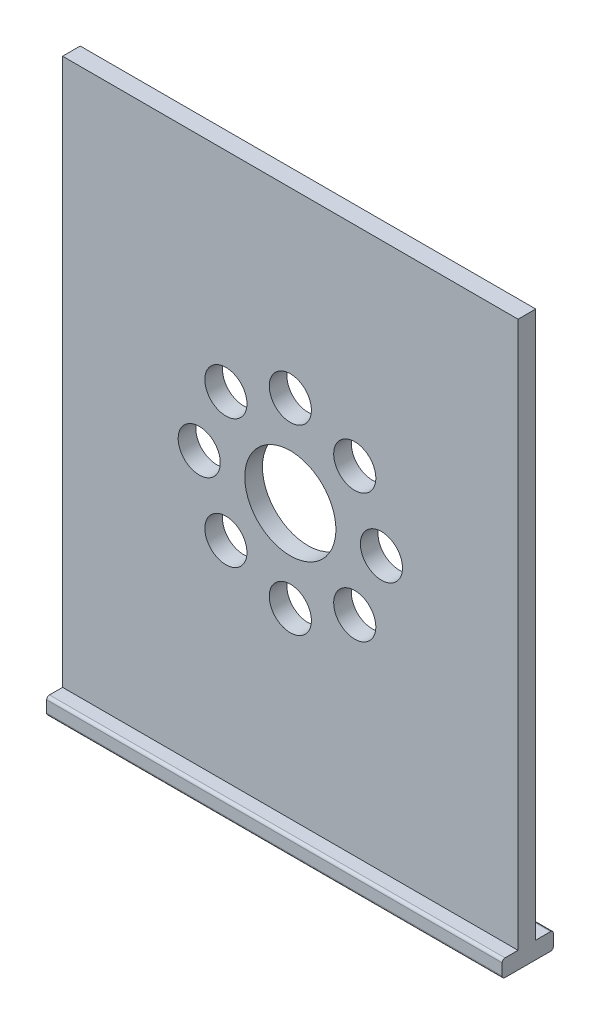
ISO-10303-21;
HEADER;
FILE_DESCRIPTION(('STEP AP214'),'2;1');
FILE_NAME('part.step','',(''),(''),'','','');
FILE_SCHEMA(('AUTOMOTIVE_DESIGN { 1 0 10303 214 1 1 1 1 }'));
ENDSEC;
DATA;
#1=APPLICATION_CONTEXT('core data for automotive mechanical design processes');
#2=APPLICATION_PROTOCOL_DEFINITION('international standard','automotive_design',2000,#1);
#3=PRODUCT_CONTEXT('',#1,'mechanical');
#4=PRODUCT('Part','Part','',(#3));
#5=PRODUCT_RELATED_PRODUCT_CATEGORY('part','',(#4));
#6=PRODUCT_DEFINITION_FORMATION('','',#4);
#7=PRODUCT_DEFINITION_CONTEXT('part definition',#1,'design');
#8=PRODUCT_DEFINITION('design','',#6,#7);
#9=PRODUCT_DEFINITION_SHAPE('','',#8);
#10=(LENGTH_UNIT() NAMED_UNIT(*) SI_UNIT(.MILLI.,.METRE.));
#11=(NAMED_UNIT(*) PLANE_ANGLE_UNIT() SI_UNIT($,.RADIAN.));
#12=(NAMED_UNIT(*) SI_UNIT($,.STERADIAN.) SOLID_ANGLE_UNIT());
#13=UNCERTAINTY_MEASURE_WITH_UNIT(LENGTH_MEASURE(1.E-05),#10,'distance_accuracy_value','');
#14=(GEOMETRIC_REPRESENTATION_CONTEXT(3) GLOBAL_UNCERTAINTY_ASSIGNED_CONTEXT((#13)) GLOBAL_UNIT_ASSIGNED_CONTEXT((#10,
#11,#12)) REPRESENTATION_CONTEXT('',''));
#15=CARTESIAN_POINT('',(0.,0.,0.));
#16=DIRECTION('',(0.,0.,1.));
#17=DIRECTION('',(1.,0.,0.));
#18=AXIS2_PLACEMENT_3D('',#15,#16,#17);
#19=CARTESIAN_POINT('',(0.,0.,-2.325));
#20=DIRECTION('',(0.,0.,1.));
#21=DIRECTION('',(1.,0.,0.));
#22=AXIS2_PLACEMENT_3D('',#19,#20,#21);
#23=PLANE('',#22);
#24=DIRECTION('',(-1.,0.,0.));
#25=VECTOR('',#24,1.);
#26=CARTESIAN_POINT('',(72.144,-25.25,-2.325));
#27=LINE('',#26,#25);
#28=CARTESIAN_POINT('',(-20.,-25.25,-2.325));
#29=VERTEX_POINT('',#28);
#30=CARTESIAN_POINT('',(20.,-25.25,-2.325));
#31=VERTEX_POINT('',#30);
#32=EDGE_CURVE('E151',#29,#31,#27,.F.);
#33=ORIENTED_EDGE('',*,*,#32,.F.);
#34=DIRECTION('',(0.,1.,0.));
#35=VECTOR('',#34,1.);
#36=CARTESIAN_POINT('',(-20.,0.,-2.325));
#37=LINE('',#36,#35);
#38=CARTESIAN_POINT('',(-20.,-24.25,-2.325));
#39=VERTEX_POINT('',#38);
#40=EDGE_CURVE('E157',#39,#29,#37,.F.);
#41=ORIENTED_EDGE('',*,*,#40,.F.);
#42=DIRECTION('',(1.,0.,0.));
#43=VECTOR('',#42,1.);
#44=CARTESIAN_POINT('',(-72.144,-24.25,-2.325));
#45=LINE('',#44,#43);
#46=CARTESIAN_POINT('',(20.,-24.25,-2.325));
#47=VERTEX_POINT('',#46);
#48=EDGE_CURVE('E107',#47,#39,#45,.F.);
#49=ORIENTED_EDGE('',*,*,#48,.F.);
#50=DIRECTION('',(0.,1.,0.));
#51=VECTOR('',#50,1.);
#52=CARTESIAN_POINT('',(20.,0.,-2.325));
#53=LINE('',#52,#51);
#54=EDGE_CURVE('E103',#31,#47,#53,.T.);
#55=ORIENTED_EDGE('',*,*,#54,.F.);
#56=EDGE_LOOP('',(#33,#41,#49,#55));
#57=FACE_BOUND('',#56,.T.);
#58=ADVANCED_FACE('F14',(#57),#23,.F.);
#59=CARTESIAN_POINT('',(-72.144,-24.25,-2.075));
#60=DIRECTION('',(1.,0.,0.));
#61=DIRECTION('',(0.,0.,-1.));
#62=AXIS2_PLACEMENT_3D('',#59,#60,#61);
#63=CYLINDRICAL_SURFACE('',#62,0.25);
#64=ORIENTED_EDGE('',*,*,#48,.T.);
#65=CARTESIAN_POINT('',(-20.,-24.25,-2.075));
#66=DIRECTION('',(1.,0.,0.));
#67=DIRECTION('',(0.,0.,-1.));
#68=AXIS2_PLACEMENT_3D('',#65,#66,#67);
#69=CIRCLE('',#68,0.25);
#70=CARTESIAN_POINT('',(-20.,-24.,-2.075));
#71=VERTEX_POINT('',#70);
#72=EDGE_CURVE('E113',#39,#71,#69,.T.);
#73=ORIENTED_EDGE('',*,*,#72,.T.);
#74=DIRECTION('',(1.,0.,0.));
#75=VECTOR('',#74,1.);
#76=CARTESIAN_POINT('',(20.,-24.,-2.075));
#77=LINE('',#76,#75);
#78=CARTESIAN_POINT('',(20.,-24.,-2.075));
#79=VERTEX_POINT('',#78);
#80=EDGE_CURVE('E110',#79,#71,#77,.F.);
#81=ORIENTED_EDGE('',*,*,#80,.F.);
#82=CARTESIAN_POINT('',(20.,-24.25,-2.075));
#83=DIRECTION('',(1.,0.,0.));
#84=DIRECTION('',(0.,0.,-1.));
#85=AXIS2_PLACEMENT_3D('',#82,#83,#84);
#86=CIRCLE('',#85,0.25);
#87=EDGE_CURVE('E17',#79,#47,#86,.F.);
#88=ORIENTED_EDGE('',*,*,#87,.T.);
#89=EDGE_LOOP('',(#64,#73,#81,#88));
#90=FACE_BOUND('',#89,.T.);
#91=ADVANCED_FACE('F111',(#90),#63,.T.);
#92=CARTESIAN_POINT('',(-72.144,-25.25,1.925));
#93=DIRECTION('',(1.,0.,0.));
#94=DIRECTION('',(0.,0.,-1.));
#95=AXIS2_PLACEMENT_3D('',#92,#93,#94);
#96=CYLINDRICAL_SURFACE('',#95,0.25);
#97=DIRECTION('',(1.,0.,0.));
#98=VECTOR('',#97,1.);
#99=CARTESIAN_POINT('',(0.,-25.25,2.175));
#100=LINE('',#99,#98);
#101=CARTESIAN_POINT('',(-20.,-25.25,2.175));
#102=VERTEX_POINT('',#101);
#103=CARTESIAN_POINT('',(20.,-25.25,2.175));
#104=VERTEX_POINT('',#103);
#105=EDGE_CURVE('E147',#102,#104,#100,.T.);
#106=ORIENTED_EDGE('',*,*,#105,.F.);
#107=CARTESIAN_POINT('',(-20.,-25.25,1.925));
#108=DIRECTION('',(1.,0.,0.));
#109=DIRECTION('',(0.,0.,-1.));
#110=AXIS2_PLACEMENT_3D('',#107,#108,#109);
#111=CIRCLE('',#110,0.25);
#112=CARTESIAN_POINT('',(-20.,-25.5,1.925));
#113=VERTEX_POINT('',#112);
#114=EDGE_CURVE('E222',#102,#113,#111,.T.);
#115=ORIENTED_EDGE('',*,*,#114,.T.);
#116=DIRECTION('',(1.,0.,0.));
#117=VECTOR('',#116,1.);
#118=CARTESIAN_POINT('',(-20.,-25.5,1.925));
#119=LINE('',#118,#117);
#120=CARTESIAN_POINT('',(20.,-25.5,1.925));
#121=VERTEX_POINT('',#120);
#122=EDGE_CURVE('E115',#121,#113,#119,.F.);
#123=ORIENTED_EDGE('',*,*,#122,.F.);
#124=CARTESIAN_POINT('',(20.,-25.25,1.925));
#125=DIRECTION('',(1.,0.,0.));
#126=DIRECTION('',(0.,0.,-1.));
#127=AXIS2_PLACEMENT_3D('',#124,#125,#126);
#128=CIRCLE('',#127,0.25);
#129=EDGE_CURVE('E224',#121,#104,#128,.F.);
#130=ORIENTED_EDGE('',*,*,#129,.T.);
#131=EDGE_LOOP('',(#106,#115,#123,#130));
#132=FACE_BOUND('',#131,.T.);
#133=ADVANCED_FACE('F229',(#132),#96,.T.);
#134=CARTESIAN_POINT('',(72.144,-25.25,-2.075));
#135=DIRECTION('',(-1.,0.,0.));
#136=DIRECTION('',(0.,0.,1.));
#137=AXIS2_PLACEMENT_3D('',#134,#135,#136);
#138=CYLINDRICAL_SURFACE('',#137,0.25);
#139=ORIENTED_EDGE('',*,*,#32,.T.);
#140=CARTESIAN_POINT('',(20.,-25.25,-2.075));
#141=DIRECTION('',(-1.,0.,0.));
#142=DIRECTION('',(0.,0.,1.));
#143=AXIS2_PLACEMENT_3D('',#140,#141,#142);
#144=CIRCLE('',#143,0.25);
#145=CARTESIAN_POINT('',(20.,-25.5,-2.075));
#146=VERTEX_POINT('',#145);
#147=EDGE_CURVE('E154',#31,#146,#144,.T.);
#148=ORIENTED_EDGE('',*,*,#147,.T.);
#149=DIRECTION('',(1.,0.,0.));
#150=VECTOR('',#149,1.);
#151=CARTESIAN_POINT('',(-20.,-25.5,-2.075));
#152=LINE('',#151,#150);
#153=CARTESIAN_POINT('',(-20.,-25.5,-2.075));
#154=VERTEX_POINT('',#153);
#155=EDGE_CURVE('E243',#154,#146,#152,.T.);
#156=ORIENTED_EDGE('',*,*,#155,.F.);
#157=CARTESIAN_POINT('',(-20.,-25.25,-2.075));
#158=DIRECTION('',(-1.,0.,0.));
#159=DIRECTION('',(0.,0.,1.));
#160=AXIS2_PLACEMENT_3D('',#157,#158,#159);
#161=CIRCLE('',#160,0.25);
#162=EDGE_CURVE('E155',#154,#29,#161,.F.);
#163=ORIENTED_EDGE('',*,*,#162,.T.);
#164=EDGE_LOOP('',(#139,#148,#156,#163));
#165=FACE_BOUND('',#164,.T.);
#166=ADVANCED_FACE('F374',(#165),#138,.T.);
#167=CARTESIAN_POINT('',(0.,0.,2.175));
#168=DIRECTION('',(0.,0.,1.));
#169=DIRECTION('',(1.,0.,0.));
#170=AXIS2_PLACEMENT_3D('',#167,#168,#169);
#171=PLANE('',#170);
#172=DIRECTION('',(0.,1.,0.));
#173=VECTOR('',#172,1.);
#174=CARTESIAN_POINT('',(20.,0.,2.175));
#175=LINE('',#174,#173);
#176=CARTESIAN_POINT('',(20.,-24.25,2.175));
#177=VERTEX_POINT('',#176);
#178=EDGE_CURVE('E123',#104,#177,#175,.T.);
#179=ORIENTED_EDGE('',*,*,#178,.T.);
#180=DIRECTION('',(-1.,0.,0.));
#181=VECTOR('',#180,1.);
#182=CARTESIAN_POINT('',(72.144,-24.25,2.175));
#183=LINE('',#182,#181);
#184=CARTESIAN_POINT('',(-20.,-24.25,2.175));
#185=VERTEX_POINT('',#184);
#186=EDGE_CURVE('E131',#185,#177,#183,.F.);
#187=ORIENTED_EDGE('',*,*,#186,.F.);
#188=DIRECTION('',(0.,1.,0.));
#189=VECTOR('',#188,1.);
#190=CARTESIAN_POINT('',(-20.,0.,2.175));
#191=LINE('',#190,#189);
#192=EDGE_CURVE('E150',#185,#102,#191,.F.);
#193=ORIENTED_EDGE('',*,*,#192,.T.);
#194=ORIENTED_EDGE('',*,*,#105,.T.);
#195=EDGE_LOOP('',(#179,#187,#193,#194));
#196=FACE_BOUND('',#195,.T.);
#197=ADVANCED_FACE('F238',(#196),#171,.T.);
#198=CARTESIAN_POINT('',(20.,-24.,2.175));
#199=DIRECTION('',(0.,1.,0.));
#200=DIRECTION('',(0.,0.,1.));
#201=AXIS2_PLACEMENT_3D('',#198,#199,#200);
#202=PLANE('',#201);
#203=DIRECTION('',(0.,0.,1.));
#204=VECTOR('',#203,1.);
#205=CARTESIAN_POINT('',(20.,-24.,2.175));
#206=LINE('',#205,#204);
#207=CARTESIAN_POINT('',(20.,-24.,-0.775));
#208=VERTEX_POINT('',#207);
#209=EDGE_CURVE('E100',#208,#79,#206,.F.);
#210=ORIENTED_EDGE('',*,*,#209,.T.);
#211=ORIENTED_EDGE('',*,*,#80,.T.);
#212=DIRECTION('',(0.,0.,1.));
#213=VECTOR('',#212,1.);
#214=CARTESIAN_POINT('',(-20.,-24.,2.175));
#215=LINE('',#214,#213);
#216=CARTESIAN_POINT('',(-20.,-24.,-0.775));
#217=VERTEX_POINT('',#216);
#218=EDGE_CURVE('E121',#71,#217,#215,.T.);
#219=ORIENTED_EDGE('',*,*,#218,.T.);
#220=DIRECTION('',(1.,0.,0.));
#221=VECTOR('',#220,1.);
#222=CARTESIAN_POINT('',(0.,-24.,-0.775));
#223=LINE('',#222,#221);
#224=EDGE_CURVE('E119',#217,#208,#223,.T.);
#225=ORIENTED_EDGE('',*,*,#224,.T.);
#226=EDGE_LOOP('',(#210,#211,#219,#225));
#227=FACE_BOUND('',#226,.T.);
#228=ADVANCED_FACE('F117',(#227),#202,.T.);
#229=CARTESIAN_POINT('',(-20.,-25.5,-0.775));
#230=DIRECTION('',(0.,-1.,0.));
#231=DIRECTION('',(0.,0.,-1.));
#232=AXIS2_PLACEMENT_3D('',#229,#230,#231);
#233=PLANE('',#232);
#234=DIRECTION('',(0.,0.,1.));
#235=VECTOR('',#234,1.);
#236=CARTESIAN_POINT('',(-20.,-25.5,-0.775));
#237=LINE('',#236,#235);
#238=EDGE_CURVE('E215',#154,#113,#237,.T.);
#239=ORIENTED_EDGE('',*,*,#238,.F.);
#240=ORIENTED_EDGE('',*,*,#155,.T.);
#241=DIRECTION('',(0.,0.,-1.));
#242=VECTOR('',#241,1.);
#243=CARTESIAN_POINT('',(20.,-25.5,-0.775));
#244=LINE('',#243,#242);
#245=EDGE_CURVE('E218',#121,#146,#244,.T.);
#246=ORIENTED_EDGE('',*,*,#245,.F.);
#247=ORIENTED_EDGE('',*,*,#122,.T.);
#248=EDGE_LOOP('',(#239,#240,#246,#247));
#249=FACE_BOUND('',#248,.T.);
#250=ADVANCED_FACE('F362',(#249),#233,.T.);
#251=CARTESIAN_POINT('',(72.144,-24.25,1.925));
#252=DIRECTION('',(-1.,0.,0.));
#253=DIRECTION('',(0.,0.,1.));
#254=AXIS2_PLACEMENT_3D('',#251,#252,#253);
#255=CYLINDRICAL_SURFACE('',#254,0.25);
#256=ORIENTED_EDGE('',*,*,#186,.T.);
#257=CARTESIAN_POINT('',(20.,-24.25,1.925));
#258=DIRECTION('',(-1.,0.,0.));
#259=DIRECTION('',(0.,0.,1.));
#260=AXIS2_PLACEMENT_3D('',#257,#258,#259);
#261=CIRCLE('',#260,0.25);
#262=CARTESIAN_POINT('',(20.,-24.,1.925));
#263=VERTEX_POINT('',#262);
#264=EDGE_CURVE('E135',#263,#177,#261,.F.);
#265=ORIENTED_EDGE('',*,*,#264,.F.);
#266=DIRECTION('',(1.,0.,0.));
#267=VECTOR('',#266,1.);
#268=CARTESIAN_POINT('',(20.,-24.,1.925));
#269=LINE('',#268,#267);
#270=CARTESIAN_POINT('',(-20.,-24.,1.925));
#271=VERTEX_POINT('',#270);
#272=EDGE_CURVE('E212',#271,#263,#269,.T.);
#273=ORIENTED_EDGE('',*,*,#272,.F.);
#274=CARTESIAN_POINT('',(-20.,-24.25,1.925));
#275=DIRECTION('',(-1.,0.,0.));
#276=DIRECTION('',(0.,0.,1.));
#277=AXIS2_PLACEMENT_3D('',#274,#275,#276);
#278=CIRCLE('',#277,0.25);
#279=EDGE_CURVE('E213',#185,#271,#278,.T.);
#280=ORIENTED_EDGE('',*,*,#279,.F.);
#281=EDGE_LOOP('',(#256,#265,#273,#280));
#282=FACE_BOUND('',#281,.T.);
#283=ADVANCED_FACE('F354',(#282),#255,.T.);
#284=CARTESIAN_POINT('',(0.,0.,-0.775));
#285=DIRECTION('',(0.,0.,1.));
#286=DIRECTION('',(1.,0.,0.));
#287=AXIS2_PLACEMENT_3D('',#284,#285,#286);
#288=PLANE('',#287);
#289=CARTESIAN_POINT('',(5.65685424949238,5.65685424949238,-0.775));
#290=DIRECTION('',(0.,0.,-1.));
#291=DIRECTION('',(-1.,0.,0.));
#292=AXIS2_PLACEMENT_3D('',#289,#290,#291);
#293=CIRCLE('',#292,1.85);
#294=CARTESIAN_POINT('',(3.80685424949238,5.65685424949238,-0.775));
#295=VERTEX_POINT('',#294);
#296=EDGE_CURVE('E184',#295,#295,#293,.F.);
#297=ORIENTED_EDGE('',*,*,#296,.T.);
#298=EDGE_LOOP('',(#297));
#299=FACE_BOUND('',#298,.T.);
#300=CARTESIAN_POINT('',(0.,8.,-0.775));
#301=DIRECTION('',(0.,0.,-1.));
#302=DIRECTION('',(-1.,0.,0.));
#303=AXIS2_PLACEMENT_3D('',#300,#301,#302);
#304=CIRCLE('',#303,1.85);
#305=CARTESIAN_POINT('',(-1.85,8.,-0.775));
#306=VERTEX_POINT('',#305);
#307=EDGE_CURVE('E188',#306,#306,#304,.F.);
#308=ORIENTED_EDGE('',*,*,#307,.T.);
#309=EDGE_LOOP('',(#308));
#310=FACE_BOUND('',#309,.T.);
#311=CARTESIAN_POINT('',(-5.65685424949238,5.65685424949238,-0.775));
#312=DIRECTION('',(0.,0.,-1.));
#313=DIRECTION('',(-1.,0.,0.));
#314=AXIS2_PLACEMENT_3D('',#311,#312,#313);
#315=CIRCLE('',#314,1.85);
#316=CARTESIAN_POINT('',(-7.50685424949238,5.65685424949238,-0.775));
#317=VERTEX_POINT('',#316);
#318=EDGE_CURVE('E191',#317,#317,#315,.F.);
#319=ORIENTED_EDGE('',*,*,#318,.T.);
#320=EDGE_LOOP('',(#319));
#321=FACE_BOUND('',#320,.T.);
#322=CARTESIAN_POINT('',(-8.,0.,-0.775));
#323=DIRECTION('',(0.,0.,-1.));
#324=DIRECTION('',(-1.,0.,0.));
#325=AXIS2_PLACEMENT_3D('',#322,#323,#324);
#326=CIRCLE('',#325,1.85);
#327=CARTESIAN_POINT('',(-9.85,0.,-0.775));
#328=VERTEX_POINT('',#327);
#329=EDGE_CURVE('E194',#328,#328,#326,.F.);
#330=ORIENTED_EDGE('',*,*,#329,.T.);
#331=EDGE_LOOP('',(#330));
#332=FACE_BOUND('',#331,.T.);
#333=CARTESIAN_POINT('',(-5.65685424949238,-5.65685424949238,-0.775));
#334=DIRECTION('',(0.,0.,-1.));
#335=DIRECTION('',(-1.,0.,0.));
#336=AXIS2_PLACEMENT_3D('',#333,#334,#335);
#337=CIRCLE('',#336,1.85);
#338=CARTESIAN_POINT('',(-7.50685424949238,-5.65685424949238,-0.775));
#339=VERTEX_POINT('',#338);
#340=EDGE_CURVE('E197',#339,#339,#337,.F.);
#341=ORIENTED_EDGE('',*,*,#340,.T.);
#342=EDGE_LOOP('',(#341));
#343=FACE_BOUND('',#342,.T.);
#344=CARTESIAN_POINT('',(0.,-8.,-0.775));
#345=DIRECTION('',(0.,0.,-1.));
#346=DIRECTION('',(-1.,0.,0.));
#347=AXIS2_PLACEMENT_3D('',#344,#345,#346);
#348=CIRCLE('',#347,1.85);
#349=CARTESIAN_POINT('',(-1.85,-8.,-0.775));
#350=VERTEX_POINT('',#349);
#351=EDGE_CURVE('E200',#350,#350,#348,.F.);
#352=ORIENTED_EDGE('',*,*,#351,.T.);
#353=EDGE_LOOP('',(#352));
#354=FACE_BOUND('',#353,.T.);
#355=CARTESIAN_POINT('',(5.65685424949238,-5.65685424949238,-0.775));
#356=DIRECTION('',(0.,0.,-1.));
#357=DIRECTION('',(-1.,0.,0.));
#358=AXIS2_PLACEMENT_3D('',#355,#356,#357);
#359=CIRCLE('',#358,1.85);
#360=CARTESIAN_POINT('',(3.80685424949238,-5.65685424949238,-0.775));
#361=VERTEX_POINT('',#360);
#362=EDGE_CURVE('E203',#361,#361,#359,.F.);
#363=ORIENTED_EDGE('',*,*,#362,.T.);
#364=EDGE_LOOP('',(#363));
#365=FACE_BOUND('',#364,.T.);
#366=CARTESIAN_POINT('',(8.,0.,-0.775));
#367=DIRECTION('',(0.,0.,-1.));
#368=DIRECTION('',(-1.,0.,0.));
#369=AXIS2_PLACEMENT_3D('',#366,#367,#368);
#370=CIRCLE('',#369,1.85);
#371=CARTESIAN_POINT('',(6.15,0.,-0.775));
#372=VERTEX_POINT('',#371);
#373=EDGE_CURVE('E206',#372,#372,#370,.F.);
#374=ORIENTED_EDGE('',*,*,#373,.T.);
#375=EDGE_LOOP('',(#374));
#376=FACE_BOUND('',#375,.T.);
#377=CARTESIAN_POINT('',(0.,0.,-0.775));
#378=DIRECTION('',(0.,0.,-1.));
#379=DIRECTION('',(-1.,0.,0.));
#380=AXIS2_PLACEMENT_3D('',#377,#378,#379);
#381=CIRCLE('',#380,4.);
#382=CARTESIAN_POINT('',(-4.,0.,-0.775));
#383=VERTEX_POINT('',#382);
#384=EDGE_CURVE('E209',#383,#383,#381,.F.);
#385=ORIENTED_EDGE('',*,*,#384,.T.);
#386=EDGE_LOOP('',(#385));
#387=FACE_BOUND('',#386,.T.);
#388=DIRECTION('',(1.,0.,0.));
#389=VECTOR('',#388,1.);
#390=CARTESIAN_POINT('',(20.,24.,-0.775));
#391=LINE('',#390,#389);
#392=CARTESIAN_POINT('',(20.,24.,-0.775));
#393=VERTEX_POINT('',#392);
#394=CARTESIAN_POINT('',(-20.,24.,-0.775));
#395=VERTEX_POINT('',#394);
#396=EDGE_CURVE('E274',#393,#395,#391,.F.);
#397=ORIENTED_EDGE('',*,*,#396,.F.);
#398=DIRECTION('',(0.,1.,0.));
#399=VECTOR('',#398,1.);
#400=CARTESIAN_POINT('',(20.,-25.5,-0.775));
#401=LINE('',#400,#399);
#402=EDGE_CURVE('E130',#208,#393,#401,.T.);
#403=ORIENTED_EDGE('',*,*,#402,.F.);
#404=ORIENTED_EDGE('',*,*,#224,.F.);
#405=DIRECTION('',(0.,-1.,0.));
#406=VECTOR('',#405,1.);
#407=CARTESIAN_POINT('',(-20.,24.,-0.775));
#408=LINE('',#407,#406);
#409=EDGE_CURVE('E140',#395,#217,#408,.T.);
#410=ORIENTED_EDGE('',*,*,#409,.F.);
#411=EDGE_LOOP('',(#397,#403,#404,#410));
#412=FACE_BOUND('',#411,.T.);
#413=ADVANCED_FACE('F292',(#299,#310,#321,#332,#343,#354,#365,#376,#387,#412),#288,.F.);
#414=CARTESIAN_POINT('',(20.,-25.5,-0.775));
#415=DIRECTION('',(1.,0.,0.));
#416=DIRECTION('',(0.,0.,-1.));
#417=AXIS2_PLACEMENT_3D('',#414,#415,#416);
#418=PLANE('',#417);
#419=ORIENTED_EDGE('',*,*,#54,.T.);
#420=ORIENTED_EDGE('',*,*,#87,.F.);
#421=ORIENTED_EDGE('',*,*,#209,.F.);
#422=ORIENTED_EDGE('',*,*,#402,.T.);
#423=DIRECTION('',(0.,0.,1.));
#424=VECTOR('',#423,1.);
#425=CARTESIAN_POINT('',(20.,24.,-0.775));
#426=LINE('',#425,#424);
#427=CARTESIAN_POINT('',(20.,24.,0.775));
#428=VERTEX_POINT('',#427);
#429=EDGE_CURVE('E271',#428,#393,#426,.F.);
#430=ORIENTED_EDGE('',*,*,#429,.F.);
#431=DIRECTION('',(0.,1.,0.));
#432=VECTOR('',#431,1.);
#433=CARTESIAN_POINT('',(20.,0.,0.775));
#434=LINE('',#433,#432);
#435=CARTESIAN_POINT('',(20.,-24.,0.775));
#436=VERTEX_POINT('',#435);
#437=EDGE_CURVE('E187',#436,#428,#434,.T.);
#438=ORIENTED_EDGE('',*,*,#437,.F.);
#439=DIRECTION('',(0.,0.,1.));
#440=VECTOR('',#439,1.);
#441=CARTESIAN_POINT('',(20.,-24.,2.175));
#442=LINE('',#441,#440);
#443=EDGE_CURVE('E143',#263,#436,#442,.F.);
#444=ORIENTED_EDGE('',*,*,#443,.F.);
#445=ORIENTED_EDGE('',*,*,#264,.T.);
#446=ORIENTED_EDGE('',*,*,#178,.F.);
#447=ORIENTED_EDGE('',*,*,#129,.F.);
#448=ORIENTED_EDGE('',*,*,#245,.T.);
#449=ORIENTED_EDGE('',*,*,#147,.F.);
#450=EDGE_LOOP('',(#419,#420,#421,#422,#430,#438,#444,#445,#446,#447,#448,#449));
#451=FACE_BOUND('',#450,.T.);
#452=ADVANCED_FACE('F97',(#451),#418,.T.);
#453=CARTESIAN_POINT('',(20.,24.,-0.775));
#454=DIRECTION('',(0.,1.,0.));
#455=DIRECTION('',(0.,0.,1.));
#456=AXIS2_PLACEMENT_3D('',#453,#454,#455);
#457=PLANE('',#456);
#458=ORIENTED_EDGE('',*,*,#429,.T.);
#459=ORIENTED_EDGE('',*,*,#396,.T.);
#460=DIRECTION('',(0.,0.,1.));
#461=VECTOR('',#460,1.);
#462=CARTESIAN_POINT('',(-20.,24.,-0.775));
#463=LINE('',#462,#461);
#464=CARTESIAN_POINT('',(-20.,24.,0.775));
#465=VERTEX_POINT('',#464);
#466=EDGE_CURVE('E144',#465,#395,#463,.F.);
#467=ORIENTED_EDGE('',*,*,#466,.F.);
#468=DIRECTION('',(1.,0.,0.));
#469=VECTOR('',#468,1.);
#470=CARTESIAN_POINT('',(0.,24.,0.775));
#471=LINE('',#470,#469);
#472=EDGE_CURVE('E251',#428,#465,#471,.F.);
#473=ORIENTED_EDGE('',*,*,#472,.F.);
#474=EDGE_LOOP('',(#458,#459,#467,#473));
#475=FACE_BOUND('',#474,.T.);
#476=ADVANCED_FACE('F286',(#475),#457,.T.);
#477=CARTESIAN_POINT('',(-20.,24.,-0.775));
#478=DIRECTION('',(-1.,0.,0.));
#479=DIRECTION('',(0.,-1.,0.));
#480=AXIS2_PLACEMENT_3D('',#477,#478,#479);
#481=PLANE('',#480);
#482=ORIENTED_EDGE('',*,*,#218,.F.);
#483=ORIENTED_EDGE('',*,*,#72,.F.);
#484=ORIENTED_EDGE('',*,*,#40,.T.);
#485=ORIENTED_EDGE('',*,*,#162,.F.);
#486=ORIENTED_EDGE('',*,*,#238,.T.);
#487=ORIENTED_EDGE('',*,*,#114,.F.);
#488=ORIENTED_EDGE('',*,*,#192,.F.);
#489=ORIENTED_EDGE('',*,*,#279,.T.);
#490=DIRECTION('',(0.,0.,1.));
#491=VECTOR('',#490,1.);
#492=CARTESIAN_POINT('',(-20.,-24.,2.175));
#493=LINE('',#492,#491);
#494=CARTESIAN_POINT('',(-20.,-24.,0.775));
#495=VERTEX_POINT('',#494);
#496=EDGE_CURVE('E32',#495,#271,#493,.T.);
#497=ORIENTED_EDGE('',*,*,#496,.F.);
#498=DIRECTION('',(0.,1.,0.));
#499=VECTOR('',#498,1.);
#500=CARTESIAN_POINT('',(-20.,0.,0.775));
#501=LINE('',#500,#499);
#502=EDGE_CURVE('E258',#465,#495,#501,.F.);
#503=ORIENTED_EDGE('',*,*,#502,.F.);
#504=ORIENTED_EDGE('',*,*,#466,.T.);
#505=ORIENTED_EDGE('',*,*,#409,.T.);
#506=EDGE_LOOP('',(#482,#483,#484,#485,#486,#487,#488,#489,#497,#503,#504,#505));
#507=FACE_BOUND('',#506,.T.);
#508=ADVANCED_FACE('F293',(#507),#481,.T.);
#509=CARTESIAN_POINT('',(20.,-24.,2.175));
#510=DIRECTION('',(0.,1.,0.));
#511=DIRECTION('',(0.,0.,1.));
#512=AXIS2_PLACEMENT_3D('',#509,#510,#511);
#513=PLANE('',#512);
#514=ORIENTED_EDGE('',*,*,#496,.T.);
#515=ORIENTED_EDGE('',*,*,#272,.T.);
#516=ORIENTED_EDGE('',*,*,#443,.T.);
#517=DIRECTION('',(1.,0.,0.));
#518=VECTOR('',#517,1.);
#519=CARTESIAN_POINT('',(0.,-24.,0.775));
#520=LINE('',#519,#518);
#521=EDGE_CURVE('E183',#495,#436,#520,.T.);
#522=ORIENTED_EDGE('',*,*,#521,.F.);
#523=EDGE_LOOP('',(#514,#515,#516,#522));
#524=FACE_BOUND('',#523,.T.);
#525=ADVANCED_FACE('F295',(#524),#513,.T.);
#526=CARTESIAN_POINT('',(0.,0.,0.775));
#527=DIRECTION('',(0.,0.,-1.));
#528=DIRECTION('',(-1.,0.,0.));
#529=AXIS2_PLACEMENT_3D('',#526,#527,#528);
#530=CYLINDRICAL_SURFACE('',#529,4.);
#531=CARTESIAN_POINT('',(0.,0.,0.775));
#532=DIRECTION('',(0.,0.,-1.));
#533=DIRECTION('',(-1.,0.,0.));
#534=AXIS2_PLACEMENT_3D('',#531,#532,#533);
#535=CIRCLE('',#534,4.);
#536=CARTESIAN_POINT('',(-4.,0.,0.775));
#537=VERTEX_POINT('',#536);
#538=EDGE_CURVE('E180',#537,#537,#535,.T.);
#539=ORIENTED_EDGE('',*,*,#538,.F.);
#540=EDGE_LOOP('',(#539));
#541=FACE_BOUND('',#540,.T.);
#542=ORIENTED_EDGE('',*,*,#384,.F.);
#543=EDGE_LOOP('',(#542));
#544=FACE_BOUND('',#543,.T.);
#545=ADVANCED_FACE('F302',(#541,#544),#530,.F.);
#546=CARTESIAN_POINT('',(8.,0.,0.775));
#547=DIRECTION('',(0.,0.,-1.));
#548=DIRECTION('',(-1.,0.,0.));
#549=AXIS2_PLACEMENT_3D('',#546,#547,#548);
#550=CYLINDRICAL_SURFACE('',#549,1.85);
#551=CARTESIAN_POINT('',(8.,0.,0.775));
#552=DIRECTION('',(0.,0.,-1.));
#553=DIRECTION('',(-1.,0.,0.));
#554=AXIS2_PLACEMENT_3D('',#551,#552,#553);
#555=CIRCLE('',#554,1.85);
#556=CARTESIAN_POINT('',(6.15,0.,0.775));
#557=VERTEX_POINT('',#556);
#558=EDGE_CURVE('E177',#557,#557,#555,.T.);
#559=ORIENTED_EDGE('',*,*,#558,.F.);
#560=EDGE_LOOP('',(#559));
#561=FACE_BOUND('',#560,.T.);
#562=ORIENTED_EDGE('',*,*,#373,.F.);
#563=EDGE_LOOP('',(#562));
#564=FACE_BOUND('',#563,.T.);
#565=ADVANCED_FACE('F340',(#561,#564),#550,.F.);
#566=CARTESIAN_POINT('',(5.65685424949238,-5.65685424949238,0.775));
#567=DIRECTION('',(0.,0.,-1.));
#568=DIRECTION('',(-1.,0.,0.));
#569=AXIS2_PLACEMENT_3D('',#566,#567,#568);
#570=CYLINDRICAL_SURFACE('',#569,1.85);
#571=CARTESIAN_POINT('',(5.65685424949238,-5.65685424949238,0.775));
#572=DIRECTION('',(0.,0.,-1.));
#573=DIRECTION('',(-1.,0.,0.));
#574=AXIS2_PLACEMENT_3D('',#571,#572,#573);
#575=CIRCLE('',#574,1.85);
#576=CARTESIAN_POINT('',(3.80685424949238,-5.65685424949238,0.775));
#577=VERTEX_POINT('',#576);
#578=EDGE_CURVE('E174',#577,#577,#575,.T.);
#579=ORIENTED_EDGE('',*,*,#578,.F.);
#580=EDGE_LOOP('',(#579));
#581=FACE_BOUND('',#580,.T.);
#582=ORIENTED_EDGE('',*,*,#362,.F.);
#583=EDGE_LOOP('',(#582));
#584=FACE_BOUND('',#583,.T.);
#585=ADVANCED_FACE('F336',(#581,#584),#570,.F.);
#586=CARTESIAN_POINT('',(0.,-8.,0.775));
#587=DIRECTION('',(0.,0.,-1.));
#588=DIRECTION('',(-1.,0.,0.));
#589=AXIS2_PLACEMENT_3D('',#586,#587,#588);
#590=CYLINDRICAL_SURFACE('',#589,1.85);
#591=CARTESIAN_POINT('',(0.,-8.,0.775));
#592=DIRECTION('',(0.,0.,-1.));
#593=DIRECTION('',(-1.,0.,0.));
#594=AXIS2_PLACEMENT_3D('',#591,#592,#593);
#595=CIRCLE('',#594,1.85);
#596=CARTESIAN_POINT('',(-1.85,-8.,0.775));
#597=VERTEX_POINT('',#596);
#598=EDGE_CURVE('E171',#597,#597,#595,.T.);
#599=ORIENTED_EDGE('',*,*,#598,.F.);
#600=EDGE_LOOP('',(#599));
#601=FACE_BOUND('',#600,.T.);
#602=ORIENTED_EDGE('',*,*,#351,.F.);
#603=EDGE_LOOP('',(#602));
#604=FACE_BOUND('',#603,.T.);
#605=ADVANCED_FACE('F332',(#601,#604),#590,.F.);
#606=CARTESIAN_POINT('',(-5.65685424949238,-5.65685424949238,0.775));
#607=DIRECTION('',(0.,0.,-1.));
#608=DIRECTION('',(-1.,0.,0.));
#609=AXIS2_PLACEMENT_3D('',#606,#607,#608);
#610=CYLINDRICAL_SURFACE('',#609,1.85);
#611=CARTESIAN_POINT('',(-5.65685424949238,-5.65685424949238,0.775));
#612=DIRECTION('',(0.,0.,-1.));
#613=DIRECTION('',(-1.,0.,0.));
#614=AXIS2_PLACEMENT_3D('',#611,#612,#613);
#615=CIRCLE('',#614,1.85);
#616=CARTESIAN_POINT('',(-7.50685424949238,-5.65685424949238,0.775));
#617=VERTEX_POINT('',#616);
#618=EDGE_CURVE('E168',#617,#617,#615,.T.);
#619=ORIENTED_EDGE('',*,*,#618,.F.);
#620=EDGE_LOOP('',(#619));
#621=FACE_BOUND('',#620,.T.);
#622=ORIENTED_EDGE('',*,*,#340,.F.);
#623=EDGE_LOOP('',(#622));
#624=FACE_BOUND('',#623,.T.);
#625=ADVANCED_FACE('F328',(#621,#624),#610,.F.);
#626=CARTESIAN_POINT('',(-8.,0.,0.775));
#627=DIRECTION('',(0.,0.,-1.));
#628=DIRECTION('',(-1.,0.,0.));
#629=AXIS2_PLACEMENT_3D('',#626,#627,#628);
#630=CYLINDRICAL_SURFACE('',#629,1.85);
#631=CARTESIAN_POINT('',(-8.,0.,0.775));
#632=DIRECTION('',(0.,0.,-1.));
#633=DIRECTION('',(-1.,0.,0.));
#634=AXIS2_PLACEMENT_3D('',#631,#632,#633);
#635=CIRCLE('',#634,1.85);
#636=CARTESIAN_POINT('',(-9.85,0.,0.775));
#637=VERTEX_POINT('',#636);
#638=EDGE_CURVE('E165',#637,#637,#635,.T.);
#639=ORIENTED_EDGE('',*,*,#638,.F.);
#640=EDGE_LOOP('',(#639));
#641=FACE_BOUND('',#640,.T.);
#642=ORIENTED_EDGE('',*,*,#329,.F.);
#643=EDGE_LOOP('',(#642));
#644=FACE_BOUND('',#643,.T.);
#645=ADVANCED_FACE('F324',(#641,#644),#630,.F.);
#646=CARTESIAN_POINT('',(-5.65685424949238,5.65685424949238,0.775));
#647=DIRECTION('',(0.,0.,-1.));
#648=DIRECTION('',(-1.,0.,0.));
#649=AXIS2_PLACEMENT_3D('',#646,#647,#648);
#650=CYLINDRICAL_SURFACE('',#649,1.85);
#651=CARTESIAN_POINT('',(-5.65685424949238,5.65685424949238,0.775));
#652=DIRECTION('',(0.,0.,-1.));
#653=DIRECTION('',(-1.,0.,0.));
#654=AXIS2_PLACEMENT_3D('',#651,#652,#653);
#655=CIRCLE('',#654,1.85);
#656=CARTESIAN_POINT('',(-7.50685424949238,5.65685424949238,0.775));
#657=VERTEX_POINT('',#656);
#658=EDGE_CURVE('E162',#657,#657,#655,.T.);
#659=ORIENTED_EDGE('',*,*,#658,.F.);
#660=EDGE_LOOP('',(#659));
#661=FACE_BOUND('',#660,.T.);
#662=ORIENTED_EDGE('',*,*,#318,.F.);
#663=EDGE_LOOP('',(#662));
#664=FACE_BOUND('',#663,.T.);
#665=ADVANCED_FACE('F320',(#661,#664),#650,.F.);
#666=CARTESIAN_POINT('',(0.,8.,0.775));
#667=DIRECTION('',(0.,0.,-1.));
#668=DIRECTION('',(-1.,0.,0.));
#669=AXIS2_PLACEMENT_3D('',#666,#667,#668);
#670=CYLINDRICAL_SURFACE('',#669,1.85);
#671=CARTESIAN_POINT('',(0.,8.,0.775));
#672=DIRECTION('',(0.,0.,-1.));
#673=DIRECTION('',(-1.,0.,0.));
#674=AXIS2_PLACEMENT_3D('',#671,#672,#673);
#675=CIRCLE('',#674,1.85);
#676=CARTESIAN_POINT('',(-1.85,8.,0.775));
#677=VERTEX_POINT('',#676);
#678=EDGE_CURVE('E23',#677,#677,#675,.T.);
#679=ORIENTED_EDGE('',*,*,#678,.F.);
#680=EDGE_LOOP('',(#679));
#681=FACE_BOUND('',#680,.T.);
#682=ORIENTED_EDGE('',*,*,#307,.F.);
#683=EDGE_LOOP('',(#682));
#684=FACE_BOUND('',#683,.T.);
#685=ADVANCED_FACE('F313',(#681,#684),#670,.F.);
#686=CARTESIAN_POINT('',(5.65685424949238,5.65685424949238,0.775));
#687=DIRECTION('',(0.,0.,-1.));
#688=DIRECTION('',(-1.,0.,0.));
#689=AXIS2_PLACEMENT_3D('',#686,#687,#688);
#690=CYLINDRICAL_SURFACE('',#689,1.85);
#691=CARTESIAN_POINT('',(5.65685424949238,5.65685424949238,0.775));
#692=DIRECTION('',(0.,0.,-1.));
#693=DIRECTION('',(-1.,0.,0.));
#694=AXIS2_PLACEMENT_3D('',#691,#692,#693);
#695=CIRCLE('',#694,1.85);
#696=CARTESIAN_POINT('',(3.80685424949238,5.65685424949238,0.775));
#697=VERTEX_POINT('',#696);
#698=EDGE_CURVE('E9',#697,#697,#695,.T.);
#699=ORIENTED_EDGE('',*,*,#698,.F.);
#700=EDGE_LOOP('',(#699));
#701=FACE_BOUND('',#700,.T.);
#702=ORIENTED_EDGE('',*,*,#296,.F.);
#703=EDGE_LOOP('',(#702));
#704=FACE_BOUND('',#703,.T.);
#705=ADVANCED_FACE('F307',(#701,#704),#690,.F.);
#706=CARTESIAN_POINT('',(0.,0.,0.775));
#707=DIRECTION('',(0.,0.,1.));
#708=DIRECTION('',(1.,0.,0.));
#709=AXIS2_PLACEMENT_3D('',#706,#707,#708);
#710=PLANE('',#709);
#711=ORIENTED_EDGE('',*,*,#698,.T.);
#712=EDGE_LOOP('',(#711));
#713=FACE_BOUND('',#712,.T.);
#714=ORIENTED_EDGE('',*,*,#678,.T.);
#715=EDGE_LOOP('',(#714));
#716=FACE_BOUND('',#715,.T.);
#717=ORIENTED_EDGE('',*,*,#658,.T.);
#718=EDGE_LOOP('',(#717));
#719=FACE_BOUND('',#718,.T.);
#720=ORIENTED_EDGE('',*,*,#638,.T.);
#721=EDGE_LOOP('',(#720));
#722=FACE_BOUND('',#721,.T.);
#723=ORIENTED_EDGE('',*,*,#618,.T.);
#724=EDGE_LOOP('',(#723));
#725=FACE_BOUND('',#724,.T.);
#726=ORIENTED_EDGE('',*,*,#598,.T.);
#727=EDGE_LOOP('',(#726));
#728=FACE_BOUND('',#727,.T.);
#729=ORIENTED_EDGE('',*,*,#578,.T.);
#730=EDGE_LOOP('',(#729));
#731=FACE_BOUND('',#730,.T.);
#732=ORIENTED_EDGE('',*,*,#558,.T.);
#733=EDGE_LOOP('',(#732));
#734=FACE_BOUND('',#733,.T.);
#735=ORIENTED_EDGE('',*,*,#538,.T.);
#736=EDGE_LOOP('',(#735));
#737=FACE_BOUND('',#736,.T.);
#738=ORIENTED_EDGE('',*,*,#502,.T.);
#739=ORIENTED_EDGE('',*,*,#521,.T.);
#740=ORIENTED_EDGE('',*,*,#437,.T.);
#741=ORIENTED_EDGE('',*,*,#472,.T.);
#742=EDGE_LOOP('',(#738,#739,#740,#741));
#743=FACE_BOUND('',#742,.T.);
#744=ADVANCED_FACE('F284',(#713,#716,#719,#722,#725,#728,#731,#734,#737,#743),#710,.T.);
#745=CLOSED_SHELL('',(#58,#91,#133,#166,#197,#228,#250,#283,#413,#452,#476,#508,#525,#545,#565,
#585,#605,#625,#645,#665,#685,#705,#744));
#746=MANIFOLD_SOLID_BREP('B1',#745);
#747=ADVANCED_BREP_SHAPE_REPRESENTATION('',(#18,#746),#14);
#748=SHAPE_DEFINITION_REPRESENTATION(#9,#747);
ENDSEC;
END-ISO-10303-21;
